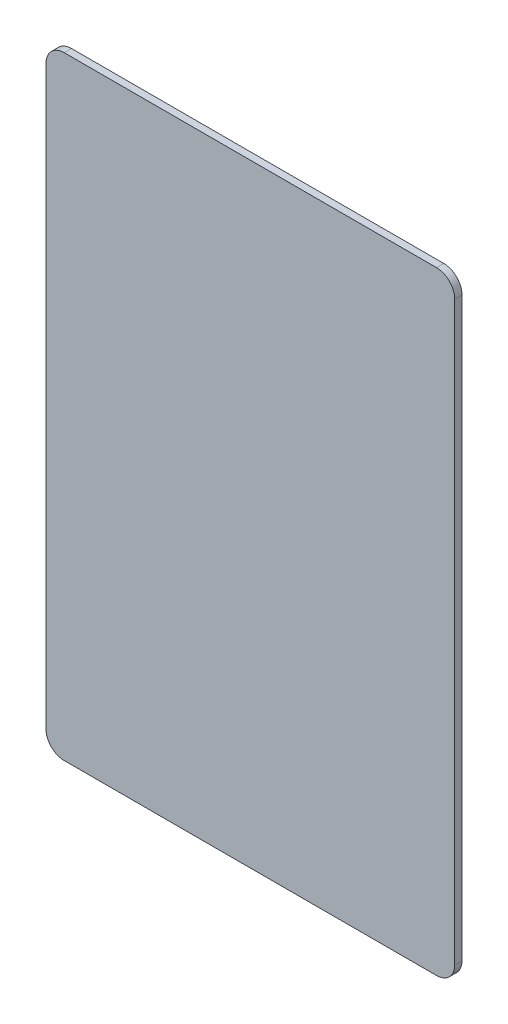
ISO-10303-21;
HEADER;
FILE_DESCRIPTION(('STEP AP214'),'2;1');
FILE_NAME('part.step','',(''),(''),'','','');
FILE_SCHEMA(('AUTOMOTIVE_DESIGN { 1 0 10303 214 1 1 1 1 }'));
ENDSEC;
DATA;
#1=APPLICATION_CONTEXT('core data for automotive mechanical design processes');
#2=APPLICATION_PROTOCOL_DEFINITION('international standard','automotive_design',2000,#1);
#3=PRODUCT_CONTEXT('',#1,'mechanical');
#4=PRODUCT('Part','Part','',(#3));
#5=PRODUCT_RELATED_PRODUCT_CATEGORY('part','',(#4));
#6=PRODUCT_DEFINITION_FORMATION('','',#4);
#7=PRODUCT_DEFINITION_CONTEXT('part definition',#1,'design');
#8=PRODUCT_DEFINITION('design','',#6,#7);
#9=PRODUCT_DEFINITION_SHAPE('','',#8);
#10=(LENGTH_UNIT() NAMED_UNIT(*) SI_UNIT(.MILLI.,.METRE.));
#11=(NAMED_UNIT(*) PLANE_ANGLE_UNIT() SI_UNIT($,.RADIAN.));
#12=(NAMED_UNIT(*) SI_UNIT($,.STERADIAN.) SOLID_ANGLE_UNIT());
#13=UNCERTAINTY_MEASURE_WITH_UNIT(LENGTH_MEASURE(1.E-05),#10,'distance_accuracy_value','');
#14=(GEOMETRIC_REPRESENTATION_CONTEXT(3) GLOBAL_UNCERTAINTY_ASSIGNED_CONTEXT((#13)) GLOBAL_UNIT_ASSIGNED_CONTEXT((#10,
#11,#12)) REPRESENTATION_CONTEXT('',''));
#15=CARTESIAN_POINT('',(0.,0.,0.));
#16=DIRECTION('',(0.,0.,1.));
#17=DIRECTION('',(1.,0.,0.));
#18=AXIS2_PLACEMENT_3D('',#15,#16,#17);
#19=CARTESIAN_POINT('',(4.00000000000002,-131.,1.6));
#20=DIRECTION('',(0.,0.,-1.));
#21=DIRECTION('',(-1.,0.,0.));
#22=AXIS2_PLACEMENT_3D('',#19,#20,#21);
#23=CYLINDRICAL_SURFACE('',#22,4.);
#24=CARTESIAN_POINT('',(4.00000000000002,-131.,0.));
#25=DIRECTION('',(0.,0.,1.));
#26=DIRECTION('',(1.,0.,0.));
#27=AXIS2_PLACEMENT_3D('',#24,#25,#26);
#28=CIRCLE('',#27,4.);
#29=CARTESIAN_POINT('',(0.,-131.,0.));
#30=VERTEX_POINT('',#29);
#31=CARTESIAN_POINT('',(4.00000000000002,-135.,0.));
#32=VERTEX_POINT('',#31);
#33=EDGE_CURVE('E140',#30,#32,#28,.T.);
#34=ORIENTED_EDGE('',*,*,#33,.T.);
#35=DIRECTION('',(0.,0.,-1.));
#36=VECTOR('',#35,1.);
#37=CARTESIAN_POINT('',(4.00000000000002,-135.,1.6));
#38=LINE('',#37,#36);
#39=CARTESIAN_POINT('',(4.00000000000002,-135.,1.6));
#40=VERTEX_POINT('',#39);
#41=EDGE_CURVE('E11',#40,#32,#38,.T.);
#42=ORIENTED_EDGE('',*,*,#41,.F.);
#43=CARTESIAN_POINT('',(4.00000000000002,-131.,1.6));
#44=DIRECTION('',(0.,0.,1.));
#45=DIRECTION('',(1.,0.,0.));
#46=AXIS2_PLACEMENT_3D('',#43,#44,#45);
#47=CIRCLE('',#46,4.);
#48=CARTESIAN_POINT('',(0.,-131.,1.6));
#49=VERTEX_POINT('',#48);
#50=EDGE_CURVE('E162',#49,#40,#47,.T.);
#51=ORIENTED_EDGE('',*,*,#50,.F.);
#52=DIRECTION('',(0.,0.,-1.));
#53=VECTOR('',#52,1.);
#54=CARTESIAN_POINT('',(0.,-131.,1.6));
#55=LINE('',#54,#53);
#56=EDGE_CURVE('E136',#49,#30,#55,.T.);
#57=ORIENTED_EDGE('',*,*,#56,.T.);
#58=EDGE_LOOP('',(#34,#42,#51,#57));
#59=FACE_BOUND('',#58,.T.);
#60=ADVANCED_FACE('F39',(#59),#23,.T.);
#61=CARTESIAN_POINT('',(4.00000000000002,-135.,1.6));
#62=DIRECTION('',(0.,1.,0.));
#63=DIRECTION('',(0.,0.,1.));
#64=AXIS2_PLACEMENT_3D('',#61,#62,#63);
#65=PLANE('',#64);
#66=DIRECTION('',(1.,0.,0.));
#67=VECTOR('',#66,1.);
#68=CARTESIAN_POINT('',(4.00000000000002,-135.,0.));
#69=LINE('',#68,#67);
#70=CARTESIAN_POINT('',(86.,-135.,0.));
#71=VERTEX_POINT('',#70);
#72=EDGE_CURVE('E144',#32,#71,#69,.T.);
#73=ORIENTED_EDGE('',*,*,#72,.T.);
#74=DIRECTION('',(0.,0.,-1.));
#75=VECTOR('',#74,1.);
#76=CARTESIAN_POINT('',(86.,-135.,1.6));
#77=LINE('',#76,#75);
#78=CARTESIAN_POINT('',(86.,-135.,1.6));
#79=VERTEX_POINT('',#78);
#80=EDGE_CURVE('E48',#79,#71,#77,.T.);
#81=ORIENTED_EDGE('',*,*,#80,.F.);
#82=DIRECTION('',(1.,0.,0.));
#83=VECTOR('',#82,1.);
#84=CARTESIAN_POINT('',(4.00000000000002,-135.,1.6));
#85=LINE('',#84,#83);
#86=EDGE_CURVE('E99',#40,#79,#85,.T.);
#87=ORIENTED_EDGE('',*,*,#86,.F.);
#88=ORIENTED_EDGE('',*,*,#41,.T.);
#89=EDGE_LOOP('',(#73,#81,#87,#88));
#90=FACE_BOUND('',#89,.T.);
#91=ADVANCED_FACE('F208',(#90),#65,.F.);
#92=CARTESIAN_POINT('',(86.,-131.,1.6));
#93=DIRECTION('',(0.,0.,-1.));
#94=DIRECTION('',(-1.,0.,0.));
#95=AXIS2_PLACEMENT_3D('',#92,#93,#94);
#96=CYLINDRICAL_SURFACE('',#95,4.);
#97=CARTESIAN_POINT('',(86.,-131.,0.));
#98=DIRECTION('',(0.,0.,1.));
#99=DIRECTION('',(1.,0.,0.));
#100=AXIS2_PLACEMENT_3D('',#97,#98,#99);
#101=CIRCLE('',#100,4.);
#102=CARTESIAN_POINT('',(90.,-131.,0.));
#103=VERTEX_POINT('',#102);
#104=EDGE_CURVE('E147',#71,#103,#101,.T.);
#105=ORIENTED_EDGE('',*,*,#104,.T.);
#106=DIRECTION('',(0.,0.,-1.));
#107=VECTOR('',#106,1.);
#108=CARTESIAN_POINT('',(90.,-131.,1.6));
#109=LINE('',#108,#107);
#110=CARTESIAN_POINT('',(90.,-131.,1.6));
#111=VERTEX_POINT('',#110);
#112=EDGE_CURVE('E173',#111,#103,#109,.T.);
#113=ORIENTED_EDGE('',*,*,#112,.F.);
#114=CARTESIAN_POINT('',(86.,-131.,1.6));
#115=DIRECTION('',(0.,0.,1.));
#116=DIRECTION('',(1.,0.,0.));
#117=AXIS2_PLACEMENT_3D('',#114,#115,#116);
#118=CIRCLE('',#117,4.);
#119=EDGE_CURVE('E183',#79,#111,#118,.T.);
#120=ORIENTED_EDGE('',*,*,#119,.F.);
#121=ORIENTED_EDGE('',*,*,#80,.T.);
#122=EDGE_LOOP('',(#105,#113,#120,#121));
#123=FACE_BOUND('',#122,.T.);
#124=ADVANCED_FACE('F181',(#123),#96,.T.);
#125=CARTESIAN_POINT('',(90.,-4.00000000000003,1.6));
#126=DIRECTION('',(-1.,0.,0.));
#127=DIRECTION('',(0.,-1.,0.));
#128=AXIS2_PLACEMENT_3D('',#125,#126,#127);
#129=PLANE('',#128);
#130=DIRECTION('',(0.,1.,0.));
#131=VECTOR('',#130,1.);
#132=CARTESIAN_POINT('',(90.,-4.00000000000003,0.));
#133=LINE('',#132,#131);
#134=CARTESIAN_POINT('',(90.,-4.00000000000003,0.));
#135=VERTEX_POINT('',#134);
#136=EDGE_CURVE('E150',#103,#135,#133,.T.);
#137=ORIENTED_EDGE('',*,*,#136,.T.);
#138=DIRECTION('',(0.,0.,-1.));
#139=VECTOR('',#138,1.);
#140=CARTESIAN_POINT('',(90.,-4.00000000000003,1.6));
#141=LINE('',#140,#139);
#142=CARTESIAN_POINT('',(90.,-4.00000000000003,1.6));
#143=VERTEX_POINT('',#142);
#144=EDGE_CURVE('E169',#143,#135,#141,.T.);
#145=ORIENTED_EDGE('',*,*,#144,.F.);
#146=DIRECTION('',(0.,1.,0.));
#147=VECTOR('',#146,1.);
#148=CARTESIAN_POINT('',(90.,-4.00000000000003,1.6));
#149=LINE('',#148,#147);
#150=EDGE_CURVE('E196',#111,#143,#149,.T.);
#151=ORIENTED_EDGE('',*,*,#150,.F.);
#152=ORIENTED_EDGE('',*,*,#112,.T.);
#153=EDGE_LOOP('',(#137,#145,#151,#152));
#154=FACE_BOUND('',#153,.T.);
#155=ADVANCED_FACE('F191',(#154),#129,.F.);
#156=CARTESIAN_POINT('',(86.,-4.,1.6));
#157=DIRECTION('',(0.,0.,-1.));
#158=DIRECTION('',(-1.,0.,0.));
#159=AXIS2_PLACEMENT_3D('',#156,#157,#158);
#160=CYLINDRICAL_SURFACE('',#159,4.);
#161=CARTESIAN_POINT('',(86.,-4.,0.));
#162=DIRECTION('',(0.,0.,1.));
#163=DIRECTION('',(-1.,0.,0.));
#164=AXIS2_PLACEMENT_3D('',#161,#162,#163);
#165=CIRCLE('',#164,4.);
#166=CARTESIAN_POINT('',(86.,0.,0.));
#167=VERTEX_POINT('',#166);
#168=EDGE_CURVE('E153',#135,#167,#165,.T.);
#169=ORIENTED_EDGE('',*,*,#168,.T.);
#170=DIRECTION('',(0.,0.,-1.));
#171=VECTOR('',#170,1.);
#172=CARTESIAN_POINT('',(86.,0.,1.6));
#173=LINE('',#172,#171);
#174=CARTESIAN_POINT('',(86.,0.,1.6));
#175=VERTEX_POINT('',#174);
#176=EDGE_CURVE('E129',#175,#167,#173,.T.);
#177=ORIENTED_EDGE('',*,*,#176,.F.);
#178=CARTESIAN_POINT('',(86.,-4.,1.6));
#179=DIRECTION('',(0.,0.,1.));
#180=DIRECTION('',(-1.,0.,0.));
#181=AXIS2_PLACEMENT_3D('',#178,#179,#180);
#182=CIRCLE('',#181,4.);
#183=EDGE_CURVE('E118',#143,#175,#182,.T.);
#184=ORIENTED_EDGE('',*,*,#183,.F.);
#185=ORIENTED_EDGE('',*,*,#144,.T.);
#186=EDGE_LOOP('',(#169,#177,#184,#185));
#187=FACE_BOUND('',#186,.T.);
#188=ADVANCED_FACE('F194',(#187),#160,.T.);
#189=CARTESIAN_POINT('',(4.00000000000003,0.,1.6));
#190=DIRECTION('',(0.,-1.,0.));
#191=DIRECTION('',(0.,0.,-1.));
#192=AXIS2_PLACEMENT_3D('',#189,#190,#191);
#193=PLANE('',#192);
#194=DIRECTION('',(-1.,0.,0.));
#195=VECTOR('',#194,1.);
#196=CARTESIAN_POINT('',(4.00000000000003,0.,0.));
#197=LINE('',#196,#195);
#198=CARTESIAN_POINT('',(4.00000000000003,0.,0.));
#199=VERTEX_POINT('',#198);
#200=EDGE_CURVE('E127',#167,#199,#197,.T.);
#201=ORIENTED_EDGE('',*,*,#200,.T.);
#202=DIRECTION('',(0.,0.,-1.));
#203=VECTOR('',#202,1.);
#204=CARTESIAN_POINT('',(4.00000000000003,0.,1.6));
#205=LINE('',#204,#203);
#206=CARTESIAN_POINT('',(4.00000000000003,0.,1.6));
#207=VERTEX_POINT('',#206);
#208=EDGE_CURVE('E124',#207,#199,#205,.T.);
#209=ORIENTED_EDGE('',*,*,#208,.F.);
#210=DIRECTION('',(-1.,0.,0.));
#211=VECTOR('',#210,1.);
#212=CARTESIAN_POINT('',(4.00000000000003,0.,1.6));
#213=LINE('',#212,#211);
#214=EDGE_CURVE('E112',#175,#207,#213,.T.);
#215=ORIENTED_EDGE('',*,*,#214,.F.);
#216=ORIENTED_EDGE('',*,*,#176,.T.);
#217=EDGE_LOOP('',(#201,#209,#215,#216));
#218=FACE_BOUND('',#217,.T.);
#219=ADVANCED_FACE('F125',(#218),#193,.F.);
#220=CARTESIAN_POINT('',(4.,-4.,1.6));
#221=DIRECTION('',(0.,0.,-1.));
#222=DIRECTION('',(-1.,0.,0.));
#223=AXIS2_PLACEMENT_3D('',#220,#221,#222);
#224=CYLINDRICAL_SURFACE('',#223,4.);
#225=CARTESIAN_POINT('',(4.,-4.,0.));
#226=DIRECTION('',(0.,0.,1.));
#227=DIRECTION('',(1.,0.,0.));
#228=AXIS2_PLACEMENT_3D('',#225,#226,#227);
#229=CIRCLE('',#228,4.);
#230=CARTESIAN_POINT('',(0.,-4.00000000000003,0.));
#231=VERTEX_POINT('',#230);
#232=EDGE_CURVE('E85',#199,#231,#229,.T.);
#233=ORIENTED_EDGE('',*,*,#232,.T.);
#234=DIRECTION('',(0.,0.,-1.));
#235=VECTOR('',#234,1.);
#236=CARTESIAN_POINT('',(0.,-4.00000000000003,1.6));
#237=LINE('',#236,#235);
#238=CARTESIAN_POINT('',(0.,-4.00000000000003,1.6));
#239=VERTEX_POINT('',#238);
#240=EDGE_CURVE('E130',#239,#231,#237,.T.);
#241=ORIENTED_EDGE('',*,*,#240,.F.);
#242=CARTESIAN_POINT('',(4.,-4.,1.6));
#243=DIRECTION('',(0.,0.,1.));
#244=DIRECTION('',(1.,0.,0.));
#245=AXIS2_PLACEMENT_3D('',#242,#243,#244);
#246=CIRCLE('',#245,4.);
#247=EDGE_CURVE('E116',#207,#239,#246,.T.);
#248=ORIENTED_EDGE('',*,*,#247,.F.);
#249=ORIENTED_EDGE('',*,*,#208,.T.);
#250=EDGE_LOOP('',(#233,#241,#248,#249));
#251=FACE_BOUND('',#250,.T.);
#252=ADVANCED_FACE('F132',(#251),#224,.T.);
#253=CARTESIAN_POINT('',(0.,-4.00000000000003,1.6));
#254=DIRECTION('',(1.,0.,0.));
#255=DIRECTION('',(0.,1.,0.));
#256=AXIS2_PLACEMENT_3D('',#253,#254,#255);
#257=PLANE('',#256);
#258=DIRECTION('',(0.,-1.,0.));
#259=VECTOR('',#258,1.);
#260=CARTESIAN_POINT('',(0.,-4.00000000000003,0.));
#261=LINE('',#260,#259);
#262=EDGE_CURVE('E91',#231,#30,#261,.T.);
#263=ORIENTED_EDGE('',*,*,#262,.T.);
#264=ORIENTED_EDGE('',*,*,#56,.F.);
#265=DIRECTION('',(0.,-1.,0.));
#266=VECTOR('',#265,1.);
#267=CARTESIAN_POINT('',(0.,-4.00000000000003,1.6));
#268=LINE('',#267,#266);
#269=EDGE_CURVE('E56',#239,#49,#268,.T.);
#270=ORIENTED_EDGE('',*,*,#269,.F.);
#271=ORIENTED_EDGE('',*,*,#240,.T.);
#272=EDGE_LOOP('',(#263,#264,#270,#271));
#273=FACE_BOUND('',#272,.T.);
#274=ADVANCED_FACE('F224',(#273),#257,.F.);
#275=CARTESIAN_POINT('',(4.00000000000002,-131.,1.6));
#276=DIRECTION('',(0.,0.,1.));
#277=DIRECTION('',(1.,0.,0.));
#278=AXIS2_PLACEMENT_3D('',#275,#276,#277);
#279=PLANE('',#278);
#280=ORIENTED_EDGE('',*,*,#50,.T.);
#281=ORIENTED_EDGE('',*,*,#86,.T.);
#282=ORIENTED_EDGE('',*,*,#119,.T.);
#283=ORIENTED_EDGE('',*,*,#150,.T.);
#284=ORIENTED_EDGE('',*,*,#183,.T.);
#285=ORIENTED_EDGE('',*,*,#214,.T.);
#286=ORIENTED_EDGE('',*,*,#247,.T.);
#287=ORIENTED_EDGE('',*,*,#269,.T.);
#288=EDGE_LOOP('',(#280,#281,#282,#283,#284,#285,#286,#287));
#289=FACE_BOUND('',#288,.T.);
#290=ADVANCED_FACE('F114',(#289),#279,.T.);
#291=CARTESIAN_POINT('',(4.00000000000002,-131.,0.));
#292=DIRECTION('',(0.,0.,1.));
#293=DIRECTION('',(1.,0.,0.));
#294=AXIS2_PLACEMENT_3D('',#291,#292,#293);
#295=PLANE('',#294);
#296=ORIENTED_EDGE('',*,*,#33,.F.);
#297=ORIENTED_EDGE('',*,*,#262,.F.);
#298=ORIENTED_EDGE('',*,*,#232,.F.);
#299=ORIENTED_EDGE('',*,*,#200,.F.);
#300=ORIENTED_EDGE('',*,*,#168,.F.);
#301=ORIENTED_EDGE('',*,*,#136,.F.);
#302=ORIENTED_EDGE('',*,*,#104,.F.);
#303=ORIENTED_EDGE('',*,*,#72,.F.);
#304=EDGE_LOOP('',(#296,#297,#298,#299,#300,#301,#302,#303));
#305=FACE_BOUND('',#304,.T.);
#306=ADVANCED_FACE('F187',(#305),#295,.F.);
#307=CLOSED_SHELL('',(#60,#91,#124,#155,#188,#219,#252,#274,#290,#306));
#308=MANIFOLD_SOLID_BREP('B2',#307);
#309=ADVANCED_BREP_SHAPE_REPRESENTATION('',(#18,#308),#14);
#310=SHAPE_DEFINITION_REPRESENTATION(#9,#309);
ENDSEC;
END-ISO-10303-21;
